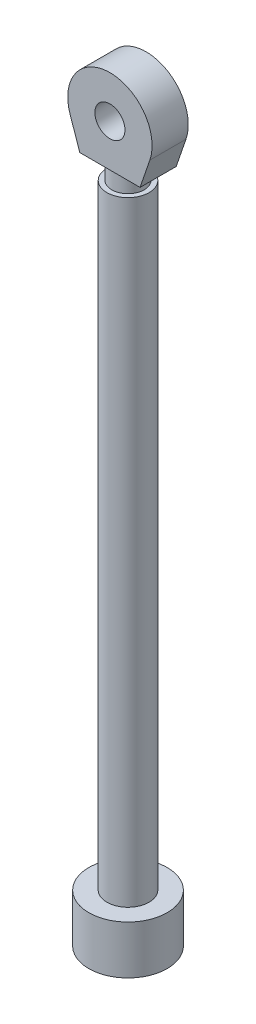
ISO-10303-21;
HEADER;
FILE_DESCRIPTION(('STEP AP214'),'2;1');
FILE_NAME('part.step','',(''),(''),'','','');
FILE_SCHEMA(('AUTOMOTIVE_DESIGN { 1 0 10303 214 1 1 1 1 }'));
ENDSEC;
DATA;
#1=APPLICATION_CONTEXT('core data for automotive mechanical design processes');
#2=APPLICATION_PROTOCOL_DEFINITION('international standard','automotive_design',2000,#1);
#3=PRODUCT_CONTEXT('',#1,'mechanical');
#4=PRODUCT('Part','Part','',(#3));
#5=PRODUCT_RELATED_PRODUCT_CATEGORY('part','',(#4));
#6=PRODUCT_DEFINITION_FORMATION('','',#4);
#7=PRODUCT_DEFINITION_CONTEXT('part definition',#1,'design');
#8=PRODUCT_DEFINITION('design','',#6,#7);
#9=PRODUCT_DEFINITION_SHAPE('','',#8);
#10=(LENGTH_UNIT() NAMED_UNIT(*) SI_UNIT(.MILLI.,.METRE.));
#11=(NAMED_UNIT(*) PLANE_ANGLE_UNIT() SI_UNIT($,.RADIAN.));
#12=(NAMED_UNIT(*) SI_UNIT($,.STERADIAN.) SOLID_ANGLE_UNIT());
#13=UNCERTAINTY_MEASURE_WITH_UNIT(LENGTH_MEASURE(1.E-05),#10,'distance_accuracy_value','');
#14=(GEOMETRIC_REPRESENTATION_CONTEXT(3) GLOBAL_UNCERTAINTY_ASSIGNED_CONTEXT((#13)) GLOBAL_UNIT_ASSIGNED_CONTEXT((#10,
#11,#12)) REPRESENTATION_CONTEXT('',''));
#15=CARTESIAN_POINT('',(0.,0.,0.));
#16=DIRECTION('',(0.,0.,1.));
#17=DIRECTION('',(1.,0.,0.));
#18=AXIS2_PLACEMENT_3D('',#15,#16,#17);
#19=CARTESIAN_POINT('',(-24.9999999999974,-34.9999999999998,15.));
#20=DIRECTION('',(0.,1.,0.));
#21=DIRECTION('',(-1.,0.,0.));
#22=AXIS2_PLACEMENT_3D('',#19,#20,#21);
#23=PLANE('',#22);
#24=DIRECTION('',(1.,0.,0.));
#25=VECTOR('',#24,1.);
#26=CARTESIAN_POINT('',(-24.9999999999974,-34.9999999999998,-15.));
#27=LINE('',#26,#25);
#28=CARTESIAN_POINT('',(-24.9999999999974,-34.9999999999998,-15.));
#29=VERTEX_POINT('',#28);
#30=CARTESIAN_POINT('',(25.0000000000023,-35.0000000000004,-15.));
#31=VERTEX_POINT('',#30);
#32=EDGE_CURVE('E97',#29,#31,#27,.T.);
#33=ORIENTED_EDGE('',*,*,#32,.T.);
#34=DIRECTION('',(0.,0.,-1.));
#35=VECTOR('',#34,1.);
#36=CARTESIAN_POINT('',(25.0000000000023,-35.0000000000004,15.));
#37=LINE('',#36,#35);
#38=CARTESIAN_POINT('',(25.0000000000023,-35.0000000000004,15.));
#39=VERTEX_POINT('',#38);
#40=EDGE_CURVE('E100',#39,#31,#37,.T.);
#41=ORIENTED_EDGE('',*,*,#40,.F.);
#42=DIRECTION('',(1.,0.,0.));
#43=VECTOR('',#42,1.);
#44=CARTESIAN_POINT('',(-24.9999999999974,-34.9999999999998,15.));
#45=LINE('',#44,#43);
#46=CARTESIAN_POINT('',(-24.9999999999974,-34.9999999999998,15.));
#47=VERTEX_POINT('',#46);
#48=EDGE_CURVE('E86',#47,#39,#45,.T.);
#49=ORIENTED_EDGE('',*,*,#48,.F.);
#50=DIRECTION('',(0.,0.,-1.));
#51=VECTOR('',#50,1.);
#52=CARTESIAN_POINT('',(-24.9999999999974,-34.9999999999998,15.));
#53=LINE('',#52,#51);
#54=EDGE_CURVE('E47',#47,#29,#53,.T.);
#55=ORIENTED_EDGE('',*,*,#54,.T.);
#56=EDGE_LOOP('',(#33,#41,#49,#55));
#57=FACE_BOUND('',#56,.T.);
#58=CARTESIAN_POINT('',(2.47289933628364E-12,-35.0000000000001,0.));
#59=DIRECTION('',(0.,1.,0.));
#60=DIRECTION('',(-1.,0.,0.));
#61=AXIS2_PLACEMENT_3D('',#58,#59,#60);
#62=CIRCLE('',#61,13.5);
#63=CARTESIAN_POINT('',(-13.4999999999975,-35.,0.));
#64=VERTEX_POINT('',#63);
#65=EDGE_CURVE('E11',#64,#64,#62,.F.);
#66=ORIENTED_EDGE('',*,*,#65,.F.);
#67=EDGE_LOOP('',(#66));
#68=FACE_BOUND('',#67,.T.);
#69=ADVANCED_FACE('F37',(#57,#68),#23,.F.);
#70=CARTESIAN_POINT('',(2.88657986402541E-12,2.51534904016637E-13,15.));
#71=DIRECTION('',(0.,0.,1.));
#72=DIRECTION('',(1.,0.,0.));
#73=AXIS2_PLACEMENT_3D('',#70,#71,#72);
#74=PLANE('',#73);
#75=DIRECTION('',(0.324324324324326,-0.945945945945945,0.));
#76=VECTOR('',#75,1.);
#77=CARTESIAN_POINT('',(-33.1081081081055,-11.3513513513514,15.));
#78=LINE('',#77,#76);
#79=CARTESIAN_POINT('',(-33.1081081081055,-11.3513513513514,15.));
#80=VERTEX_POINT('',#79);
#81=EDGE_CURVE('E94',#80,#47,#78,.T.);
#82=ORIENTED_EDGE('',*,*,#81,.T.);
#83=ORIENTED_EDGE('',*,*,#48,.T.);
#84=DIRECTION('',(0.324324324324349,0.945945945945937,0.));
#85=VECTOR('',#84,1.);
#86=CARTESIAN_POINT('',(25.0000000000023,-35.0000000000004,15.));
#87=LINE('',#86,#85);
#88=CARTESIAN_POINT('',(33.108108108111,-11.3513513513521,15.));
#89=VERTEX_POINT('',#88);
#90=EDGE_CURVE('E95',#39,#89,#87,.T.);
#91=ORIENTED_EDGE('',*,*,#90,.T.);
#92=CARTESIAN_POINT('',(2.88657986402541E-12,2.51534904016637E-13,15.));
#93=DIRECTION('',(0.,0.,1.));
#94=DIRECTION('',(1.,0.,0.));
#95=AXIS2_PLACEMENT_3D('',#92,#93,#94);
#96=CIRCLE('',#95,35.0000000000003);
#97=EDGE_CURVE('E60',#89,#80,#96,.T.);
#98=ORIENTED_EDGE('',*,*,#97,.T.);
#99=EDGE_LOOP('',(#82,#83,#91,#98));
#100=FACE_BOUND('',#99,.T.);
#101=CARTESIAN_POINT('',(2.88657986402541E-12,2.51534904016637E-13,15.));
#102=DIRECTION('',(0.,0.,1.));
#103=DIRECTION('',(1.,0.,0.));
#104=AXIS2_PLACEMENT_3D('',#101,#102,#103);
#105=CIRCLE('',#104,12.4999999999997);
#106=CARTESIAN_POINT('',(12.5000000000026,2.51534904016637E-13,15.));
#107=VERTEX_POINT('',#106);
#108=EDGE_CURVE('E112',#107,#107,#105,.T.);
#109=ORIENTED_EDGE('',*,*,#108,.F.);
#110=EDGE_LOOP('',(#109));
#111=FACE_BOUND('',#110,.T.);
#112=ADVANCED_FACE('F90',(#100,#111),#74,.T.);
#113=CARTESIAN_POINT('',(2.88657986402541E-12,2.51534904016637E-13,-15.));
#114=DIRECTION('',(0.,0.,1.));
#115=DIRECTION('',(1.,0.,0.));
#116=AXIS2_PLACEMENT_3D('',#113,#114,#115);
#117=PLANE('',#116);
#118=DIRECTION('',(0.324324324324326,-0.945945945945945,0.));
#119=VECTOR('',#118,1.);
#120=CARTESIAN_POINT('',(-33.1081081081055,-11.3513513513514,-15.));
#121=LINE('',#120,#119);
#122=CARTESIAN_POINT('',(-33.1081081081055,-11.3513513513514,-15.));
#123=VERTEX_POINT('',#122);
#124=EDGE_CURVE('E107',#123,#29,#121,.T.);
#125=ORIENTED_EDGE('',*,*,#124,.F.);
#126=CARTESIAN_POINT('',(2.88657986402541E-12,2.51534904016637E-13,-15.));
#127=DIRECTION('',(0.,0.,1.));
#128=DIRECTION('',(1.,0.,0.));
#129=AXIS2_PLACEMENT_3D('',#126,#127,#128);
#130=CIRCLE('',#129,35.0000000000003);
#131=CARTESIAN_POINT('',(33.108108108111,-11.3513513513521,-15.));
#132=VERTEX_POINT('',#131);
#133=EDGE_CURVE('E78',#132,#123,#130,.T.);
#134=ORIENTED_EDGE('',*,*,#133,.F.);
#135=DIRECTION('',(0.324324324324349,0.945945945945937,0.));
#136=VECTOR('',#135,1.);
#137=CARTESIAN_POINT('',(25.0000000000023,-35.0000000000004,-15.));
#138=LINE('',#137,#136);
#139=EDGE_CURVE('E74',#31,#132,#138,.T.);
#140=ORIENTED_EDGE('',*,*,#139,.F.);
#141=ORIENTED_EDGE('',*,*,#32,.F.);
#142=EDGE_LOOP('',(#125,#134,#140,#141));
#143=FACE_BOUND('',#142,.T.);
#144=CARTESIAN_POINT('',(2.88657986402541E-12,2.51534904016637E-13,-15.));
#145=DIRECTION('',(0.,0.,1.));
#146=DIRECTION('',(1.,0.,0.));
#147=AXIS2_PLACEMENT_3D('',#144,#145,#146);
#148=CIRCLE('',#147,12.4999999999997);
#149=CARTESIAN_POINT('',(12.5000000000026,2.51534904016637E-13,-15.));
#150=VERTEX_POINT('',#149);
#151=EDGE_CURVE('E125',#150,#150,#148,.T.);
#152=ORIENTED_EDGE('',*,*,#151,.T.);
#153=EDGE_LOOP('',(#152));
#154=FACE_BOUND('',#153,.T.);
#155=ADVANCED_FACE('F116',(#143,#154),#117,.F.);
#156=CARTESIAN_POINT('',(-33.1081081081055,-11.3513513513514,15.));
#157=DIRECTION('',(0.945945945945945,0.324324324324326,0.));
#158=DIRECTION('',(-0.324324324324326,0.945945945945945,0.));
#159=AXIS2_PLACEMENT_3D('',#156,#157,#158);
#160=PLANE('',#159);
#161=ORIENTED_EDGE('',*,*,#124,.T.);
#162=ORIENTED_EDGE('',*,*,#54,.F.);
#163=ORIENTED_EDGE('',*,*,#81,.F.);
#164=DIRECTION('',(0.,0.,-1.));
#165=VECTOR('',#164,1.);
#166=CARTESIAN_POINT('',(-33.1081081081055,-11.3513513513514,15.));
#167=LINE('',#166,#165);
#168=EDGE_CURVE('E102',#80,#123,#167,.T.);
#169=ORIENTED_EDGE('',*,*,#168,.T.);
#170=EDGE_LOOP('',(#161,#162,#163,#169));
#171=FACE_BOUND('',#170,.T.);
#172=ADVANCED_FACE('F45',(#171),#160,.F.);
#173=CARTESIAN_POINT('',(25.0000000000023,-35.0000000000004,15.));
#174=DIRECTION('',(-0.945945945945937,0.324324324324349,0.));
#175=DIRECTION('',(-0.324324324324349,-0.945945945945938,0.));
#176=AXIS2_PLACEMENT_3D('',#173,#174,#175);
#177=PLANE('',#176);
#178=ORIENTED_EDGE('',*,*,#139,.T.);
#179=DIRECTION('',(0.,0.,-1.));
#180=VECTOR('',#179,1.);
#181=CARTESIAN_POINT('',(33.108108108111,-11.3513513513521,15.));
#182=LINE('',#181,#180);
#183=EDGE_CURVE('E99',#89,#132,#182,.T.);
#184=ORIENTED_EDGE('',*,*,#183,.F.);
#185=ORIENTED_EDGE('',*,*,#90,.F.);
#186=ORIENTED_EDGE('',*,*,#40,.T.);
#187=EDGE_LOOP('',(#178,#184,#185,#186));
#188=FACE_BOUND('',#187,.T.);
#189=ADVANCED_FACE('F105',(#188),#177,.F.);
#190=CARTESIAN_POINT('',(2.88657986402541E-12,2.51534904016637E-13,15.));
#191=DIRECTION('',(0.,0.,-1.));
#192=DIRECTION('',(-1.,0.,0.));
#193=AXIS2_PLACEMENT_3D('',#190,#191,#192);
#194=CYLINDRICAL_SURFACE('',#193,35.0000000000003);
#195=ORIENTED_EDGE('',*,*,#133,.T.);
#196=ORIENTED_EDGE('',*,*,#168,.F.);
#197=ORIENTED_EDGE('',*,*,#97,.F.);
#198=ORIENTED_EDGE('',*,*,#183,.T.);
#199=EDGE_LOOP('',(#195,#196,#197,#198));
#200=FACE_BOUND('',#199,.T.);
#201=ADVANCED_FACE('F206',(#200),#194,.T.);
#202=CARTESIAN_POINT('',(2.88657986402541E-12,2.51534904016637E-13,15.));
#203=DIRECTION('',(0.,0.,-1.));
#204=DIRECTION('',(-1.,0.,0.));
#205=AXIS2_PLACEMENT_3D('',#202,#203,#204);
#206=CYLINDRICAL_SURFACE('',#205,12.4999999999997);
#207=ORIENTED_EDGE('',*,*,#108,.T.);
#208=EDGE_LOOP('',(#207));
#209=FACE_BOUND('',#208,.T.);
#210=ORIENTED_EDGE('',*,*,#151,.F.);
#211=EDGE_LOOP('',(#210));
#212=FACE_BOUND('',#211,.T.);
#213=ADVANCED_FACE('F195',(#209,#212),#206,.F.);
#214=CARTESIAN_POINT('',(3.10862446895044E-12,-560.,0.));
#215=DIRECTION('',(0.,-1.,0.));
#216=DIRECTION('',(1.,0.,0.));
#217=AXIS2_PLACEMENT_3D('',#214,#215,#216);
#218=CYLINDRICAL_SURFACE('',#217,13.5);
#219=CARTESIAN_POINT('',(2.49106291150269E-12,-50.,0.));
#220=DIRECTION('',(0.,-1.,0.));
#221=DIRECTION('',(1.,0.,0.));
#222=AXIS2_PLACEMENT_3D('',#219,#220,#221);
#223=CIRCLE('',#222,13.4999999999997);
#224=CARTESIAN_POINT('',(13.5000000000022,-50.,0.));
#225=VERTEX_POINT('',#224);
#226=EDGE_CURVE('E149',#225,#225,#223,.T.);
#227=ORIENTED_EDGE('',*,*,#226,.F.);
#228=EDGE_LOOP('',(#227));
#229=FACE_BOUND('',#228,.T.);
#230=ORIENTED_EDGE('',*,*,#65,.T.);
#231=EDGE_LOOP('',(#230));
#232=FACE_BOUND('',#231,.T.);
#233=ADVANCED_FACE('F189',(#229,#232),#218,.T.);
#234=CARTESIAN_POINT('',(13.5000000000022,-50.0000000000003,0.));
#235=DIRECTION('',(0.,-1.,0.));
#236=DIRECTION('',(1.,0.,0.));
#237=AXIS2_PLACEMENT_3D('',#234,#235,#236);
#238=PLANE('',#237);
#239=CARTESIAN_POINT('',(2.4910629115027E-12,-50.0000000000006,0.));
#240=DIRECTION('',(0.,-1.,0.));
#241=DIRECTION('',(1.,0.,0.));
#242=AXIS2_PLACEMENT_3D('',#239,#240,#241);
#243=CIRCLE('',#242,17.5);
#244=CARTESIAN_POINT('',(17.5000000000025,-50.0000000000006,0.));
#245=VERTEX_POINT('',#244);
#246=EDGE_CURVE('E155',#245,#245,#243,.T.);
#247=ORIENTED_EDGE('',*,*,#246,.F.);
#248=EDGE_LOOP('',(#247));
#249=FACE_BOUND('',#248,.T.);
#250=ORIENTED_EDGE('',*,*,#226,.T.);
#251=EDGE_LOOP('',(#250));
#252=FACE_BOUND('',#251,.T.);
#253=ADVANCED_FACE('F185',(#249,#252),#238,.F.);
#254=CARTESIAN_POINT('',(3.10862446895044E-12,-560.,0.));
#255=DIRECTION('',(0.,-1.,0.));
#256=DIRECTION('',(1.,0.,0.));
#257=AXIS2_PLACEMENT_3D('',#254,#255,#256);
#258=CYLINDRICAL_SURFACE('',#257,17.5);
#259=CARTESIAN_POINT('',(3.10862446895044E-12,-560.,0.));
#260=DIRECTION('',(0.,-1.,0.));
#261=DIRECTION('',(1.,0.,0.));
#262=AXIS2_PLACEMENT_3D('',#259,#260,#261);
#263=CIRCLE('',#262,17.5);
#264=CARTESIAN_POINT('',(17.5000000000031,-560.,0.));
#265=VERTEX_POINT('',#264);
#266=EDGE_CURVE('E154',#265,#265,#263,.T.);
#267=ORIENTED_EDGE('',*,*,#266,.F.);
#268=EDGE_LOOP('',(#267));
#269=FACE_BOUND('',#268,.T.);
#270=ORIENTED_EDGE('',*,*,#246,.T.);
#271=EDGE_LOOP('',(#270));
#272=FACE_BOUND('',#271,.T.);
#273=ADVANCED_FACE('F176',(#269,#272),#258,.T.);
#274=CARTESIAN_POINT('',(17.5000000000031,-560.,0.));
#275=DIRECTION('',(0.,-1.,0.));
#276=DIRECTION('',(1.,0.,0.));
#277=AXIS2_PLACEMENT_3D('',#274,#275,#276);
#278=PLANE('',#277);
#279=CARTESIAN_POINT('',(3.10862446895044E-12,-560.,0.));
#280=DIRECTION('',(0.,-1.,0.));
#281=DIRECTION('',(1.,0.,0.));
#282=AXIS2_PLACEMENT_3D('',#279,#280,#281);
#283=CIRCLE('',#282,32.5);
#284=CARTESIAN_POINT('',(32.5000000000031,-560.,0.));
#285=VERTEX_POINT('',#284);
#286=EDGE_CURVE('E158',#285,#285,#283,.T.);
#287=ORIENTED_EDGE('',*,*,#286,.F.);
#288=EDGE_LOOP('',(#287));
#289=FACE_BOUND('',#288,.T.);
#290=ORIENTED_EDGE('',*,*,#266,.T.);
#291=EDGE_LOOP('',(#290));
#292=FACE_BOUND('',#291,.T.);
#293=ADVANCED_FACE('F168',(#289,#292),#278,.F.);
#294=CARTESIAN_POINT('',(3.10862446895044E-12,-560.,0.));
#295=DIRECTION('',(0.,-1.,0.));
#296=DIRECTION('',(1.,0.,0.));
#297=AXIS2_PLACEMENT_3D('',#294,#295,#296);
#298=CYLINDRICAL_SURFACE('',#297,32.5);
#299=CARTESIAN_POINT('',(3.15732975632452E-12,-600.222219568591,0.));
#300=DIRECTION('',(0.,-1.,0.));
#301=DIRECTION('',(1.,0.,0.));
#302=AXIS2_PLACEMENT_3D('',#299,#300,#301);
#303=CIRCLE('',#302,32.5);
#304=CARTESIAN_POINT('',(32.5000000000031,-600.222219568591,0.));
#305=VERTEX_POINT('',#304);
#306=EDGE_CURVE('E161',#305,#305,#303,.T.);
#307=ORIENTED_EDGE('',*,*,#306,.F.);
#308=EDGE_LOOP('',(#307));
#309=FACE_BOUND('',#308,.T.);
#310=ORIENTED_EDGE('',*,*,#286,.T.);
#311=EDGE_LOOP('',(#310));
#312=FACE_BOUND('',#311,.T.);
#313=ADVANCED_FACE('F170',(#309,#312),#298,.T.);
#314=CARTESIAN_POINT('',(32.5000000000031,-600.222219568591,0.));
#315=DIRECTION('',(0.,1.,0.));
#316=DIRECTION('',(-1.,0.,0.));
#317=AXIS2_PLACEMENT_3D('',#314,#315,#316);
#318=PLANE('',#317);
#319=ORIENTED_EDGE('',*,*,#306,.T.);
#320=EDGE_LOOP('',(#319));
#321=FACE_BOUND('',#320,.T.);
#322=ADVANCED_FACE('F164',(#321),#318,.F.);
#323=CLOSED_SHELL('',(#69,#112,#155,#172,#189,#201,#213,#233,#253,#273,#293,#313,#322));
#324=CARTESIAN_POINT('',(32.5000000000031,-590.222219568591,0.));
#325=DIRECTION('',(0.,1.,0.));
#326=DIRECTION('',(-1.,0.,0.));
#327=AXIS2_PLACEMENT_3D('',#324,#325,#326);
#328=PLANE('',#327);
#329=CARTESIAN_POINT('',(3.14522070617849E-12,-590.222219568591,0.));
#330=DIRECTION('',(0.,-1.,0.));
#331=DIRECTION('',(1.,0.,0.));
#332=AXIS2_PLACEMENT_3D('',#329,#330,#331);
#333=CIRCLE('',#332,22.5);
#334=CARTESIAN_POINT('',(22.5000000000031,-590.222219568591,0.));
#335=VERTEX_POINT('',#334);
#336=EDGE_CURVE('E130',#335,#335,#333,.T.);
#337=ORIENTED_EDGE('',*,*,#336,.F.);
#338=EDGE_LOOP('',(#337));
#339=FACE_BOUND('',#338,.T.);
#340=ADVANCED_FACE('F211',(#339),#328,.T.);
#341=CARTESIAN_POINT('',(3.10862446895044E-12,-560.,0.));
#342=DIRECTION('',(0.,-1.,0.));
#343=DIRECTION('',(1.,0.,0.));
#344=AXIS2_PLACEMENT_3D('',#341,#342,#343);
#345=CYLINDRICAL_SURFACE('',#344,22.5);
#346=ORIENTED_EDGE('',*,*,#336,.T.);
#347=EDGE_LOOP('',(#346));
#348=FACE_BOUND('',#347,.T.);
#349=CARTESIAN_POINT('',(3.12073351909647E-12,-570.,0.));
#350=DIRECTION('',(0.,-1.,0.));
#351=DIRECTION('',(1.,0.,0.));
#352=AXIS2_PLACEMENT_3D('',#349,#350,#351);
#353=CIRCLE('',#352,22.5);
#354=CARTESIAN_POINT('',(22.5000000000031,-570.,0.));
#355=VERTEX_POINT('',#354);
#356=EDGE_CURVE('E135',#355,#355,#353,.T.);
#357=ORIENTED_EDGE('',*,*,#356,.F.);
#358=EDGE_LOOP('',(#357));
#359=FACE_BOUND('',#358,.T.);
#360=ADVANCED_FACE('F212',(#348,#359),#345,.F.);
#361=CARTESIAN_POINT('',(17.5000000000032,-570.,0.));
#362=DIRECTION('',(0.,-1.,0.));
#363=DIRECTION('',(1.,0.,0.));
#364=AXIS2_PLACEMENT_3D('',#361,#362,#363);
#365=PLANE('',#364);
#366=ORIENTED_EDGE('',*,*,#356,.T.);
#367=EDGE_LOOP('',(#366));
#368=FACE_BOUND('',#367,.T.);
#369=CARTESIAN_POINT('',(3.12073351909647E-12,-570.,0.));
#370=DIRECTION('',(0.,-1.,0.));
#371=DIRECTION('',(1.,0.,0.));
#372=AXIS2_PLACEMENT_3D('',#369,#370,#371);
#373=CIRCLE('',#372,7.5);
#374=CARTESIAN_POINT('',(7.50000000000312,-570.,0.));
#375=VERTEX_POINT('',#374);
#376=EDGE_CURVE('E139',#375,#375,#373,.T.);
#377=ORIENTED_EDGE('',*,*,#376,.F.);
#378=EDGE_LOOP('',(#377));
#379=FACE_BOUND('',#378,.T.);
#380=ADVANCED_FACE('F218',(#368,#379),#365,.T.);
#381=CARTESIAN_POINT('',(3.10862446895044E-12,-560.,0.));
#382=DIRECTION('',(0.,-1.,0.));
#383=DIRECTION('',(1.,0.,0.));
#384=AXIS2_PLACEMENT_3D('',#381,#382,#383);
#385=CYLINDRICAL_SURFACE('',#384,7.5);
#386=ORIENTED_EDGE('',*,*,#376,.T.);
#387=EDGE_LOOP('',(#386));
#388=FACE_BOUND('',#387,.T.);
#389=CARTESIAN_POINT('',(2.50317196164873E-12,-59.9999999999993,0.));
#390=DIRECTION('',(0.,-1.,0.));
#391=DIRECTION('',(1.,0.,0.));
#392=AXIS2_PLACEMENT_3D('',#389,#390,#391);
#393=CIRCLE('',#392,7.5);
#394=CARTESIAN_POINT('',(7.5000000000025,-59.9999999999993,0.));
#395=VERTEX_POINT('',#394);
#396=EDGE_CURVE('E136',#395,#395,#393,.T.);
#397=ORIENTED_EDGE('',*,*,#396,.F.);
#398=EDGE_LOOP('',(#397));
#399=FACE_BOUND('',#398,.T.);
#400=ADVANCED_FACE('F224',(#388,#399),#385,.F.);
#401=CARTESIAN_POINT('',(13.5000000000009,-59.999999999999,0.));
#402=DIRECTION('',(0.,-1.,0.));
#403=DIRECTION('',(1.,0.,0.));
#404=AXIS2_PLACEMENT_3D('',#401,#402,#403);
#405=PLANE('',#404);
#406=ORIENTED_EDGE('',*,*,#396,.T.);
#407=EDGE_LOOP('',(#406));
#408=FACE_BOUND('',#407,.T.);
#409=CARTESIAN_POINT('',(2.50317196164873E-12,-59.9999999999987,0.));
#410=DIRECTION('',(0.,-1.,0.));
#411=DIRECTION('',(1.,0.,0.));
#412=AXIS2_PLACEMENT_3D('',#409,#410,#411);
#413=CIRCLE('',#412,3.49999999999937);
#414=CARTESIAN_POINT('',(3.50000000000187,-59.9999999999987,0.));
#415=VERTEX_POINT('',#414);
#416=EDGE_CURVE('E141',#415,#415,#413,.T.);
#417=ORIENTED_EDGE('',*,*,#416,.F.);
#418=EDGE_LOOP('',(#417));
#419=FACE_BOUND('',#418,.T.);
#420=ADVANCED_FACE('F230',(#408,#419),#405,.T.);
#421=CARTESIAN_POINT('',(3.10862446895044E-12,-560.,0.));
#422=DIRECTION('',(0.,-1.,0.));
#423=DIRECTION('',(1.,0.,0.));
#424=AXIS2_PLACEMENT_3D('',#421,#422,#423);
#425=CYLINDRICAL_SURFACE('',#424,3.49999999999964);
#426=ORIENTED_EDGE('',*,*,#416,.T.);
#427=EDGE_LOOP('',(#426));
#428=FACE_BOUND('',#427,.T.);
#429=CARTESIAN_POINT('',(2.48500838642968E-12,-44.9999999999998,0.));
#430=DIRECTION('',(0.,-1.,0.));
#431=DIRECTION('',(1.,0.,0.));
#432=AXIS2_PLACEMENT_3D('',#429,#430,#431);
#433=CIRCLE('',#432,3.49999999999992);
#434=CARTESIAN_POINT('',(3.5000000000024,-44.9999999999998,0.));
#435=VERTEX_POINT('',#434);
#436=EDGE_CURVE('E148',#435,#435,#433,.T.);
#437=ORIENTED_EDGE('',*,*,#436,.F.);
#438=EDGE_LOOP('',(#437));
#439=FACE_BOUND('',#438,.T.);
#440=ADVANCED_FACE('F231',(#428,#439),#425,.F.);
#441=CARTESIAN_POINT('',(2.54863003129807E-12,-44.9999999999998,0.));
#442=DIRECTION('',(0.,-1.,0.));
#443=DIRECTION('',(1.,0.,0.));
#444=AXIS2_PLACEMENT_3D('',#441,#442,#443);
#445=PLANE('',#444);
#446=ORIENTED_EDGE('',*,*,#436,.T.);
#447=EDGE_LOOP('',(#446));
#448=FACE_BOUND('',#447,.T.);
#449=ADVANCED_FACE('F235',(#448),#445,.T.);
#450=CLOSED_SHELL('',(#340,#360,#380,#400,#420,#440,#449));
#451=ORIENTED_CLOSED_SHELL('',*,#450,.T.);
#452=BREP_WITH_VOIDS('B2',#323,(#451));
#453=ADVANCED_BREP_SHAPE_REPRESENTATION('',(#18,#452),#14);
#454=SHAPE_DEFINITION_REPRESENTATION(#9,#453);
ENDSEC;
END-ISO-10303-21;
